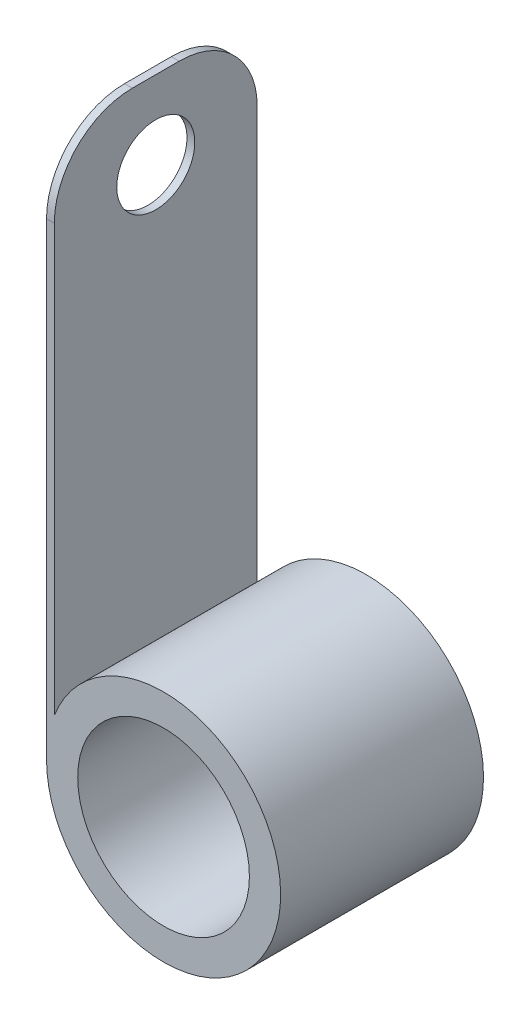
ISO-10303-21;
HEADER;
FILE_DESCRIPTION(('STEP AP214'),'2;1');
FILE_NAME('part.step','',(''),(''),'','','');
FILE_SCHEMA(('AUTOMOTIVE_DESIGN { 1 0 10303 214 1 1 1 1 }'));
ENDSEC;
DATA;
#1=APPLICATION_CONTEXT('core data for automotive mechanical design processes');
#2=APPLICATION_PROTOCOL_DEFINITION('international standard','automotive_design',2000,#1);
#3=PRODUCT_CONTEXT('',#1,'mechanical');
#4=PRODUCT('Part','Part','',(#3));
#5=PRODUCT_RELATED_PRODUCT_CATEGORY('part','',(#4));
#6=PRODUCT_DEFINITION_FORMATION('','',#4);
#7=PRODUCT_DEFINITION_CONTEXT('part definition',#1,'design');
#8=PRODUCT_DEFINITION('design','',#6,#7);
#9=PRODUCT_DEFINITION_SHAPE('','',#8);
#10=(LENGTH_UNIT() NAMED_UNIT(*) SI_UNIT(.MILLI.,.METRE.));
#11=(NAMED_UNIT(*) PLANE_ANGLE_UNIT() SI_UNIT($,.RADIAN.));
#12=(NAMED_UNIT(*) SI_UNIT($,.STERADIAN.) SOLID_ANGLE_UNIT());
#13=UNCERTAINTY_MEASURE_WITH_UNIT(LENGTH_MEASURE(1.E-05),#10,'distance_accuracy_value','');
#14=(GEOMETRIC_REPRESENTATION_CONTEXT(3) GLOBAL_UNCERTAINTY_ASSIGNED_CONTEXT((#13)) GLOBAL_UNIT_ASSIGNED_CONTEXT((#10,
#11,#12)) REPRESENTATION_CONTEXT('',''));
#15=CARTESIAN_POINT('',(0.,0.,0.));
#16=DIRECTION('',(0.,0.,1.));
#17=DIRECTION('',(1.,0.,0.));
#18=AXIS2_PLACEMENT_3D('',#15,#16,#17);
#19=CARTESIAN_POINT('',(0.,0.,13.));
#20=DIRECTION('',(0.,0.,-1.));
#21=DIRECTION('',(-1.,0.,0.));
#22=AXIS2_PLACEMENT_3D('',#19,#20,#21);
#23=CYLINDRICAL_SURFACE('',#22,7.5);
#24=DIRECTION('',(0.,0.,-1.));
#25=VECTOR('',#24,1.);
#26=CARTESIAN_POINT('',(-7.,2.69258240356726,13.));
#27=LINE('',#26,#25);
#28=CARTESIAN_POINT('',(-7.,2.69258240356726,13.));
#29=VERTEX_POINT('',#28);
#30=CARTESIAN_POINT('',(-7.,2.69258240356725,0.));
#31=VERTEX_POINT('',#30);
#32=EDGE_CURVE('E104',#29,#31,#27,.T.);
#33=ORIENTED_EDGE('',*,*,#32,.F.);
#34=CARTESIAN_POINT('',(0.,0.,13.));
#35=DIRECTION('',(0.,0.,1.));
#36=DIRECTION('',(1.,0.,0.));
#37=AXIS2_PLACEMENT_3D('',#34,#35,#36);
#38=CIRCLE('',#37,7.5);
#39=CARTESIAN_POINT('',(-7.5,0.,13.));
#40=VERTEX_POINT('',#39);
#41=EDGE_CURVE('E89',#40,#29,#38,.T.);
#42=ORIENTED_EDGE('',*,*,#41,.F.);
#43=DIRECTION('',(0.,0.,1.));
#44=VECTOR('',#43,1.);
#45=CARTESIAN_POINT('',(-7.5,0.,0.));
#46=LINE('',#45,#44);
#47=CARTESIAN_POINT('',(-7.5,0.,0.));
#48=VERTEX_POINT('',#47);
#49=EDGE_CURVE('E101',#48,#40,#46,.T.);
#50=ORIENTED_EDGE('',*,*,#49,.F.);
#51=CARTESIAN_POINT('',(0.,0.,0.));
#52=DIRECTION('',(0.,0.,1.));
#53=DIRECTION('',(1.,0.,0.));
#54=AXIS2_PLACEMENT_3D('',#51,#52,#53);
#55=CIRCLE('',#54,7.5);
#56=EDGE_CURVE('E105',#48,#31,#55,.T.);
#57=ORIENTED_EDGE('',*,*,#56,.T.);
#58=EDGE_LOOP('',(#33,#42,#50,#57));
#59=FACE_BOUND('',#58,.T.);
#60=ADVANCED_FACE('F32',(#59),#23,.T.);
#61=CARTESIAN_POINT('',(0.,0.,13.));
#62=DIRECTION('',(0.,0.,1.));
#63=DIRECTION('',(1.,0.,0.));
#64=AXIS2_PLACEMENT_3D('',#61,#62,#63);
#65=PLANE('',#64);
#66=DIRECTION('',(0.,-1.,0.));
#67=VECTOR('',#66,1.);
#68=CARTESIAN_POINT('',(-7.,35.,13.));
#69=LINE('',#68,#67);
#70=CARTESIAN_POINT('',(-7.,30.,13.));
#71=VERTEX_POINT('',#70);
#72=EDGE_CURVE('E95',#71,#29,#69,.T.);
#73=ORIENTED_EDGE('',*,*,#72,.F.);
#74=DIRECTION('',(1.,0.,0.));
#75=VECTOR('',#74,1.);
#76=CARTESIAN_POINT('',(0.,30.,13.));
#77=LINE('',#76,#75);
#78=CARTESIAN_POINT('',(-7.5,30.,13.));
#79=VERTEX_POINT('',#78);
#80=EDGE_CURVE('E11',#71,#79,#77,.F.);
#81=ORIENTED_EDGE('',*,*,#80,.T.);
#82=DIRECTION('',(0.,-1.,0.));
#83=VECTOR('',#82,1.);
#84=CARTESIAN_POINT('',(-7.5,35.,13.));
#85=LINE('',#84,#83);
#86=EDGE_CURVE('E85',#79,#40,#85,.T.);
#87=ORIENTED_EDGE('',*,*,#86,.T.);
#88=ORIENTED_EDGE('',*,*,#41,.T.);
#89=EDGE_LOOP('',(#73,#81,#87,#88));
#90=FACE_BOUND('',#89,.T.);
#91=CARTESIAN_POINT('',(0.,0.,13.));
#92=DIRECTION('',(0.,0.,1.));
#93=DIRECTION('',(1.,0.,0.));
#94=AXIS2_PLACEMENT_3D('',#91,#92,#93);
#95=CIRCLE('',#94,5.5);
#96=CARTESIAN_POINT('',(5.5,0.,13.));
#97=VERTEX_POINT('',#96);
#98=EDGE_CURVE('E125',#97,#97,#95,.T.);
#99=ORIENTED_EDGE('',*,*,#98,.F.);
#100=EDGE_LOOP('',(#99));
#101=FACE_BOUND('',#100,.T.);
#102=ADVANCED_FACE('F87',(#90,#101),#65,.T.);
#103=CARTESIAN_POINT('',(0.,0.,0.));
#104=DIRECTION('',(0.,0.,1.));
#105=DIRECTION('',(1.,0.,0.));
#106=AXIS2_PLACEMENT_3D('',#103,#104,#105);
#107=PLANE('',#106);
#108=DIRECTION('',(0.,-1.,0.));
#109=VECTOR('',#108,1.);
#110=CARTESIAN_POINT('',(-7.5,35.,0.));
#111=LINE('',#110,#109);
#112=CARTESIAN_POINT('',(-7.5,30.,0.));
#113=VERTEX_POINT('',#112);
#114=EDGE_CURVE('E109',#113,#48,#111,.T.);
#115=ORIENTED_EDGE('',*,*,#114,.F.);
#116=DIRECTION('',(-1.,0.,0.));
#117=VECTOR('',#116,1.);
#118=CARTESIAN_POINT('',(-7.,30.,0.));
#119=LINE('',#118,#117);
#120=CARTESIAN_POINT('',(-7.,30.,0.));
#121=VERTEX_POINT('',#120);
#122=EDGE_CURVE('E55',#113,#121,#119,.F.);
#123=ORIENTED_EDGE('',*,*,#122,.T.);
#124=DIRECTION('',(0.,-1.,0.));
#125=VECTOR('',#124,1.);
#126=CARTESIAN_POINT('',(-7.,35.,0.));
#127=LINE('',#126,#125);
#128=EDGE_CURVE('E122',#121,#31,#127,.T.);
#129=ORIENTED_EDGE('',*,*,#128,.T.);
#130=ORIENTED_EDGE('',*,*,#56,.F.);
#131=EDGE_LOOP('',(#115,#123,#129,#130));
#132=FACE_BOUND('',#131,.T.);
#133=CARTESIAN_POINT('',(0.,0.,0.));
#134=DIRECTION('',(0.,0.,1.));
#135=DIRECTION('',(1.,0.,0.));
#136=AXIS2_PLACEMENT_3D('',#133,#134,#135);
#137=CIRCLE('',#136,5.5);
#138=CARTESIAN_POINT('',(5.5,0.,0.));
#139=VERTEX_POINT('',#138);
#140=EDGE_CURVE('E94',#139,#139,#137,.T.);
#141=ORIENTED_EDGE('',*,*,#140,.T.);
#142=EDGE_LOOP('',(#141));
#143=FACE_BOUND('',#142,.T.);
#144=ADVANCED_FACE('F152',(#132,#143),#107,.F.);
#145=CARTESIAN_POINT('',(0.,0.,13.));
#146=DIRECTION('',(0.,0.,-1.));
#147=DIRECTION('',(-1.,0.,0.));
#148=AXIS2_PLACEMENT_3D('',#145,#146,#147);
#149=CYLINDRICAL_SURFACE('',#148,5.5);
#150=ORIENTED_EDGE('',*,*,#98,.T.);
#151=EDGE_LOOP('',(#150));
#152=FACE_BOUND('',#151,.T.);
#153=ORIENTED_EDGE('',*,*,#140,.F.);
#154=EDGE_LOOP('',(#153));
#155=FACE_BOUND('',#154,.T.);
#156=ADVANCED_FACE('F168',(#152,#155),#149,.F.);
#157=CARTESIAN_POINT('',(-7.,35.,0.));
#158=DIRECTION('',(-1.,0.,0.));
#159=DIRECTION('',(0.,0.,1.));
#160=AXIS2_PLACEMENT_3D('',#157,#158,#159);
#161=PLANE('',#160);
#162=CARTESIAN_POINT('',(-7.,30.,6.5));
#163=DIRECTION('',(-1.,0.,0.));
#164=DIRECTION('',(0.,0.,1.));
#165=AXIS2_PLACEMENT_3D('',#162,#163,#164);
#166=CIRCLE('',#165,2.5);
#167=CARTESIAN_POINT('',(-7.,30.,9.));
#168=VERTEX_POINT('',#167);
#169=EDGE_CURVE('E111',#168,#168,#166,.T.);
#170=ORIENTED_EDGE('',*,*,#169,.T.);
#171=EDGE_LOOP('',(#170));
#172=FACE_BOUND('',#171,.T.);
#173=ORIENTED_EDGE('',*,*,#128,.F.);
#174=CARTESIAN_POINT('',(-7.,30.,5.));
#175=DIRECTION('',(-1.,0.,0.));
#176=DIRECTION('',(0.,0.,1.));
#177=AXIS2_PLACEMENT_3D('',#174,#175,#176);
#178=CIRCLE('',#177,5.);
#179=CARTESIAN_POINT('',(-7.,35.,5.));
#180=VERTEX_POINT('',#179);
#181=EDGE_CURVE('E40',#121,#180,#178,.F.);
#182=ORIENTED_EDGE('',*,*,#181,.T.);
#183=DIRECTION('',(0.,0.,-1.));
#184=VECTOR('',#183,1.);
#185=CARTESIAN_POINT('',(-7.,35.,0.));
#186=LINE('',#185,#184);
#187=CARTESIAN_POINT('',(-7.,35.,8.));
#188=VERTEX_POINT('',#187);
#189=EDGE_CURVE('E114',#188,#180,#186,.T.);
#190=ORIENTED_EDGE('',*,*,#189,.F.);
#191=CARTESIAN_POINT('',(-7.,30.,8.));
#192=DIRECTION('',(-1.,0.,0.));
#193=DIRECTION('',(0.,0.,1.));
#194=AXIS2_PLACEMENT_3D('',#191,#192,#193);
#195=CIRCLE('',#194,5.);
#196=EDGE_CURVE('E47',#188,#71,#195,.F.);
#197=ORIENTED_EDGE('',*,*,#196,.T.);
#198=ORIENTED_EDGE('',*,*,#72,.T.);
#199=ORIENTED_EDGE('',*,*,#32,.T.);
#200=EDGE_LOOP('',(#173,#182,#190,#197,#198,#199));
#201=FACE_BOUND('',#200,.T.);
#202=ADVANCED_FACE('F145',(#172,#201),#161,.F.);
#203=CARTESIAN_POINT('',(-7.5,35.,0.));
#204=DIRECTION('',(1.,0.,0.));
#205=DIRECTION('',(0.,0.,-1.));
#206=AXIS2_PLACEMENT_3D('',#203,#204,#205);
#207=PLANE('',#206);
#208=CARTESIAN_POINT('',(-7.5,30.,6.5));
#209=DIRECTION('',(-1.,0.,0.));
#210=DIRECTION('',(0.,0.,1.));
#211=AXIS2_PLACEMENT_3D('',#208,#209,#210);
#212=CIRCLE('',#211,2.5);
#213=CARTESIAN_POINT('',(-7.5,30.,9.));
#214=VERTEX_POINT('',#213);
#215=EDGE_CURVE('E117',#214,#214,#212,.T.);
#216=ORIENTED_EDGE('',*,*,#215,.F.);
#217=EDGE_LOOP('',(#216));
#218=FACE_BOUND('',#217,.T.);
#219=DIRECTION('',(0.,0.,1.));
#220=VECTOR('',#219,1.);
#221=CARTESIAN_POINT('',(-7.5,35.,0.));
#222=LINE('',#221,#220);
#223=CARTESIAN_POINT('',(-7.5,35.,5.));
#224=VERTEX_POINT('',#223);
#225=CARTESIAN_POINT('',(-7.5,35.,8.));
#226=VERTEX_POINT('',#225);
#227=EDGE_CURVE('E110',#224,#226,#222,.T.);
#228=ORIENTED_EDGE('',*,*,#227,.F.);
#229=CARTESIAN_POINT('',(-7.5,30.,5.));
#230=DIRECTION('',(1.,0.,0.));
#231=DIRECTION('',(0.,0.,-1.));
#232=AXIS2_PLACEMENT_3D('',#229,#230,#231);
#233=CIRCLE('',#232,5.);
#234=EDGE_CURVE('E140',#224,#113,#233,.F.);
#235=ORIENTED_EDGE('',*,*,#234,.T.);
#236=ORIENTED_EDGE('',*,*,#114,.T.);
#237=ORIENTED_EDGE('',*,*,#49,.T.);
#238=ORIENTED_EDGE('',*,*,#86,.F.);
#239=CARTESIAN_POINT('',(-7.5,30.,8.));
#240=DIRECTION('',(1.,0.,0.));
#241=DIRECTION('',(0.,0.,-1.));
#242=AXIS2_PLACEMENT_3D('',#239,#240,#241);
#243=CIRCLE('',#242,5.);
#244=EDGE_CURVE('E138',#79,#226,#243,.F.);
#245=ORIENTED_EDGE('',*,*,#244,.T.);
#246=EDGE_LOOP('',(#228,#235,#236,#237,#238,#245));
#247=FACE_BOUND('',#246,.T.);
#248=ADVANCED_FACE('F108',(#218,#247),#207,.F.);
#249=CARTESIAN_POINT('',(0.,35.,0.));
#250=DIRECTION('',(0.,1.,0.));
#251=DIRECTION('',(0.,0.,1.));
#252=AXIS2_PLACEMENT_3D('',#249,#250,#251);
#253=PLANE('',#252);
#254=ORIENTED_EDGE('',*,*,#189,.T.);
#255=DIRECTION('',(-1.,0.,0.));
#256=VECTOR('',#255,1.);
#257=CARTESIAN_POINT('',(-7.5,35.,5.));
#258=LINE('',#257,#256);
#259=EDGE_CURVE('E135',#180,#224,#258,.T.);
#260=ORIENTED_EDGE('',*,*,#259,.T.);
#261=ORIENTED_EDGE('',*,*,#227,.T.);
#262=DIRECTION('',(1.,0.,0.));
#263=VECTOR('',#262,1.);
#264=CARTESIAN_POINT('',(0.,35.,8.));
#265=LINE('',#264,#263);
#266=EDGE_CURVE('E132',#226,#188,#265,.T.);
#267=ORIENTED_EDGE('',*,*,#266,.T.);
#268=EDGE_LOOP('',(#254,#260,#261,#267));
#269=FACE_BOUND('',#268,.T.);
#270=ADVANCED_FACE('F149',(#269),#253,.T.);
#271=CARTESIAN_POINT('',(12.5,30.,6.5));
#272=DIRECTION('',(-1.,0.,0.));
#273=DIRECTION('',(0.,0.,1.));
#274=AXIS2_PLACEMENT_3D('',#271,#272,#273);
#275=CYLINDRICAL_SURFACE('',#274,2.5);
#276=ORIENTED_EDGE('',*,*,#215,.T.);
#277=EDGE_LOOP('',(#276));
#278=FACE_BOUND('',#277,.T.);
#279=ORIENTED_EDGE('',*,*,#169,.F.);
#280=EDGE_LOOP('',(#279));
#281=FACE_BOUND('',#280,.T.);
#282=ADVANCED_FACE('F159',(#278,#281),#275,.F.);
#283=CARTESIAN_POINT('',(0.,30.,5.));
#284=DIRECTION('',(1.,0.,0.));
#285=DIRECTION('',(0.,0.,-1.));
#286=AXIS2_PLACEMENT_3D('',#283,#284,#285);
#287=CYLINDRICAL_SURFACE('',#286,5.);
#288=ORIENTED_EDGE('',*,*,#181,.F.);
#289=ORIENTED_EDGE('',*,*,#122,.F.);
#290=ORIENTED_EDGE('',*,*,#234,.F.);
#291=ORIENTED_EDGE('',*,*,#259,.F.);
#292=EDGE_LOOP('',(#288,#289,#290,#291));
#293=FACE_BOUND('',#292,.T.);
#294=ADVANCED_FACE('F151',(#293),#287,.T.);
#295=CARTESIAN_POINT('',(0.,30.,8.));
#296=DIRECTION('',(1.,0.,0.));
#297=DIRECTION('',(0.,0.,-1.));
#298=AXIS2_PLACEMENT_3D('',#295,#296,#297);
#299=CYLINDRICAL_SURFACE('',#298,5.);
#300=ORIENTED_EDGE('',*,*,#244,.F.);
#301=ORIENTED_EDGE('',*,*,#80,.F.);
#302=ORIENTED_EDGE('',*,*,#196,.F.);
#303=ORIENTED_EDGE('',*,*,#266,.F.);
#304=EDGE_LOOP('',(#300,#301,#302,#303));
#305=FACE_BOUND('',#304,.T.);
#306=ADVANCED_FACE('F34',(#305),#299,.T.);
#307=CLOSED_SHELL('',(#60,#102,#144,#156,#202,#248,#270,#282,#294,#306));
#308=MANIFOLD_SOLID_BREP('B2',#307);
#309=ADVANCED_BREP_SHAPE_REPRESENTATION('',(#18,#308),#14);
#310=SHAPE_DEFINITION_REPRESENTATION(#9,#309);
ENDSEC;
END-ISO-10303-21;
